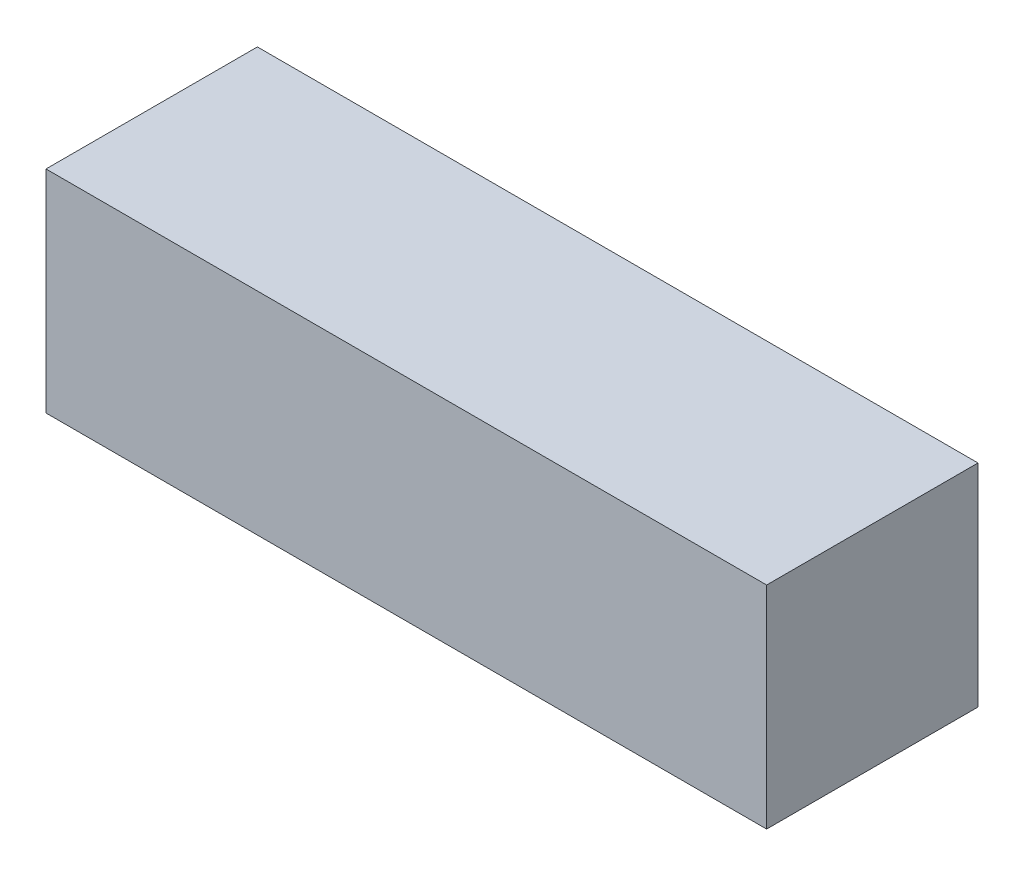
ISO-10303-21;
HEADER;
FILE_DESCRIPTION(('STEP AP214'),'2;1');
FILE_NAME('part.step','',(''),(''),'','','');
FILE_SCHEMA(('AUTOMOTIVE_DESIGN { 1 0 10303 214 1 1 1 1 }'));
ENDSEC;
DATA;
#1=APPLICATION_CONTEXT('core data for automotive mechanical design processes');
#2=APPLICATION_PROTOCOL_DEFINITION('international standard','automotive_design',2000,#1);
#3=PRODUCT_CONTEXT('',#1,'mechanical');
#4=PRODUCT('Part','Part','',(#3));
#5=PRODUCT_RELATED_PRODUCT_CATEGORY('part','',(#4));
#6=PRODUCT_DEFINITION_FORMATION('','',#4);
#7=PRODUCT_DEFINITION_CONTEXT('part definition',#1,'design');
#8=PRODUCT_DEFINITION('design','',#6,#7);
#9=PRODUCT_DEFINITION_SHAPE('','',#8);
#10=(LENGTH_UNIT() NAMED_UNIT(*) SI_UNIT(.MILLI.,.METRE.));
#11=(NAMED_UNIT(*) PLANE_ANGLE_UNIT() SI_UNIT($,.RADIAN.));
#12=(NAMED_UNIT(*) SI_UNIT($,.STERADIAN.) SOLID_ANGLE_UNIT());
#13=UNCERTAINTY_MEASURE_WITH_UNIT(LENGTH_MEASURE(1.E-05),#10,'distance_accuracy_value','');
#14=(GEOMETRIC_REPRESENTATION_CONTEXT(3) GLOBAL_UNCERTAINTY_ASSIGNED_CONTEXT((#13)) GLOBAL_UNIT_ASSIGNED_CONTEXT((#10,
#11,#12)) REPRESENTATION_CONTEXT('',''));
#15=CARTESIAN_POINT('',(0.,0.,0.));
#16=DIRECTION('',(0.,0.,1.));
#17=DIRECTION('',(1.,0.,0.));
#18=AXIS2_PLACEMENT_3D('',#15,#16,#17);
#19=CARTESIAN_POINT('',(0.,11.176,0.));
#20=DIRECTION('',(1.,0.,0.));
#21=DIRECTION('',(0.,0.,-1.));
#22=AXIS2_PLACEMENT_3D('',#19,#20,#21);
#23=PLANE('',#22);
#24=DIRECTION('',(0.,0.,1.));
#25=VECTOR('',#24,1.);
#26=CARTESIAN_POINT('',(0.,0.,0.));
#27=LINE('',#26,#25);
#28=CARTESIAN_POINT('',(0.,0.,-11.176));
#29=VERTEX_POINT('',#28);
#30=CARTESIAN_POINT('',(0.,0.,0.));
#31=VERTEX_POINT('',#30);
#32=EDGE_CURVE('E97',#29,#31,#27,.T.);
#33=ORIENTED_EDGE('',*,*,#32,.T.);
#34=DIRECTION('',(0.,-1.,0.));
#35=VECTOR('',#34,1.);
#36=CARTESIAN_POINT('',(0.,11.176,0.));
#37=LINE('',#36,#35);
#38=CARTESIAN_POINT('',(0.,11.176,0.));
#39=VERTEX_POINT('',#38);
#40=EDGE_CURVE('E11',#39,#31,#37,.T.);
#41=ORIENTED_EDGE('',*,*,#40,.F.);
#42=DIRECTION('',(0.,0.,1.));
#43=VECTOR('',#42,1.);
#44=CARTESIAN_POINT('',(0.,11.176,0.));
#45=LINE('',#44,#43);
#46=CARTESIAN_POINT('',(0.,11.176,-11.176));
#47=VERTEX_POINT('',#46);
#48=EDGE_CURVE('E85',#47,#39,#45,.T.);
#49=ORIENTED_EDGE('',*,*,#48,.F.);
#50=DIRECTION('',(0.,-1.,0.));
#51=VECTOR('',#50,1.);
#52=CARTESIAN_POINT('',(0.,11.176,-11.176));
#53=LINE('',#52,#51);
#54=EDGE_CURVE('E93',#47,#29,#53,.T.);
#55=ORIENTED_EDGE('',*,*,#54,.T.);
#56=EDGE_LOOP('',(#33,#41,#49,#55));
#57=FACE_BOUND('',#56,.T.);
#58=ADVANCED_FACE('F34',(#57),#23,.F.);
#59=CARTESIAN_POINT('',(0.,11.176,0.));
#60=DIRECTION('',(0.,0.,-1.));
#61=DIRECTION('',(-1.,0.,0.));
#62=AXIS2_PLACEMENT_3D('',#59,#60,#61);
#63=PLANE('',#62);
#64=DIRECTION('',(1.,0.,0.));
#65=VECTOR('',#64,1.);
#66=CARTESIAN_POINT('',(0.,0.,0.));
#67=LINE('',#66,#65);
#68=CARTESIAN_POINT('',(38.1,0.,0.));
#69=VERTEX_POINT('',#68);
#70=EDGE_CURVE('E89',#31,#69,#67,.T.);
#71=ORIENTED_EDGE('',*,*,#70,.T.);
#72=DIRECTION('',(0.,-1.,0.));
#73=VECTOR('',#72,1.);
#74=CARTESIAN_POINT('',(38.1,11.176,0.));
#75=LINE('',#74,#73);
#76=CARTESIAN_POINT('',(38.1,11.176,0.));
#77=VERTEX_POINT('',#76);
#78=EDGE_CURVE('E42',#77,#69,#75,.T.);
#79=ORIENTED_EDGE('',*,*,#78,.F.);
#80=DIRECTION('',(1.,0.,0.));
#81=VECTOR('',#80,1.);
#82=CARTESIAN_POINT('',(0.,11.176,0.));
#83=LINE('',#82,#81);
#84=EDGE_CURVE('E80',#39,#77,#83,.T.);
#85=ORIENTED_EDGE('',*,*,#84,.F.);
#86=ORIENTED_EDGE('',*,*,#40,.T.);
#87=EDGE_LOOP('',(#71,#79,#85,#86));
#88=FACE_BOUND('',#87,.T.);
#89=ADVANCED_FACE('F88',(#88),#63,.F.);
#90=CARTESIAN_POINT('',(38.1,11.176,0.));
#91=DIRECTION('',(-1.,0.,0.));
#92=DIRECTION('',(0.,0.,1.));
#93=AXIS2_PLACEMENT_3D('',#90,#91,#92);
#94=PLANE('',#93);
#95=DIRECTION('',(0.,0.,-1.));
#96=VECTOR('',#95,1.);
#97=CARTESIAN_POINT('',(38.1,0.,0.));
#98=LINE('',#97,#96);
#99=CARTESIAN_POINT('',(38.1,0.,-11.176));
#100=VERTEX_POINT('',#99);
#101=EDGE_CURVE('E67',#69,#100,#98,.T.);
#102=ORIENTED_EDGE('',*,*,#101,.T.);
#103=DIRECTION('',(0.,-1.,0.));
#104=VECTOR('',#103,1.);
#105=CARTESIAN_POINT('',(38.1,11.176,-11.176));
#106=LINE('',#105,#104);
#107=CARTESIAN_POINT('',(38.1,11.176,-11.176));
#108=VERTEX_POINT('',#107);
#109=EDGE_CURVE('E90',#108,#100,#106,.T.);
#110=ORIENTED_EDGE('',*,*,#109,.F.);
#111=DIRECTION('',(0.,0.,-1.));
#112=VECTOR('',#111,1.);
#113=CARTESIAN_POINT('',(38.1,11.176,0.));
#114=LINE('',#113,#112);
#115=EDGE_CURVE('E83',#77,#108,#114,.T.);
#116=ORIENTED_EDGE('',*,*,#115,.F.);
#117=ORIENTED_EDGE('',*,*,#78,.T.);
#118=EDGE_LOOP('',(#102,#110,#116,#117));
#119=FACE_BOUND('',#118,.T.);
#120=ADVANCED_FACE('F91',(#119),#94,.F.);
#121=CARTESIAN_POINT('',(0.,11.176,-11.176));
#122=DIRECTION('',(0.,0.,1.));
#123=DIRECTION('',(1.,0.,0.));
#124=AXIS2_PLACEMENT_3D('',#121,#122,#123);
#125=PLANE('',#124);
#126=DIRECTION('',(-1.,0.,0.));
#127=VECTOR('',#126,1.);
#128=CARTESIAN_POINT('',(0.,0.,-11.176));
#129=LINE('',#128,#127);
#130=EDGE_CURVE('E73',#100,#29,#129,.T.);
#131=ORIENTED_EDGE('',*,*,#130,.T.);
#132=ORIENTED_EDGE('',*,*,#54,.F.);
#133=DIRECTION('',(-1.,0.,0.));
#134=VECTOR('',#133,1.);
#135=CARTESIAN_POINT('',(0.,11.176,-11.176));
#136=LINE('',#135,#134);
#137=EDGE_CURVE('E50',#108,#47,#136,.T.);
#138=ORIENTED_EDGE('',*,*,#137,.F.);
#139=ORIENTED_EDGE('',*,*,#109,.T.);
#140=EDGE_LOOP('',(#131,#132,#138,#139));
#141=FACE_BOUND('',#140,.T.);
#142=ADVANCED_FACE('F104',(#141),#125,.F.);
#143=CARTESIAN_POINT('',(0.,11.176,0.));
#144=DIRECTION('',(0.,-1.,0.));
#145=DIRECTION('',(0.,0.,-1.));
#146=AXIS2_PLACEMENT_3D('',#143,#144,#145);
#147=PLANE('',#146);
#148=ORIENTED_EDGE('',*,*,#48,.T.);
#149=ORIENTED_EDGE('',*,*,#84,.T.);
#150=ORIENTED_EDGE('',*,*,#115,.T.);
#151=ORIENTED_EDGE('',*,*,#137,.T.);
#152=EDGE_LOOP('',(#148,#149,#150,#151));
#153=FACE_BOUND('',#152,.T.);
#154=ADVANCED_FACE('F81',(#153),#147,.F.);
#155=CARTESIAN_POINT('',(0.,0.,0.));
#156=DIRECTION('',(0.,-1.,0.));
#157=DIRECTION('',(0.,0.,-1.));
#158=AXIS2_PLACEMENT_3D('',#155,#156,#157);
#159=PLANE('',#158);
#160=ORIENTED_EDGE('',*,*,#32,.F.);
#161=ORIENTED_EDGE('',*,*,#130,.F.);
#162=ORIENTED_EDGE('',*,*,#101,.F.);
#163=ORIENTED_EDGE('',*,*,#70,.F.);
#164=EDGE_LOOP('',(#160,#161,#162,#163));
#165=FACE_BOUND('',#164,.T.);
#166=ADVANCED_FACE('F107',(#165),#159,.T.);
#167=CLOSED_SHELL('',(#58,#89,#120,#142,#154,#166));
#168=MANIFOLD_SOLID_BREP('B2',#167);
#169=ADVANCED_BREP_SHAPE_REPRESENTATION('',(#18,#168),#14);
#170=SHAPE_DEFINITION_REPRESENTATION(#9,#169);
ENDSEC;
END-ISO-10303-21;
